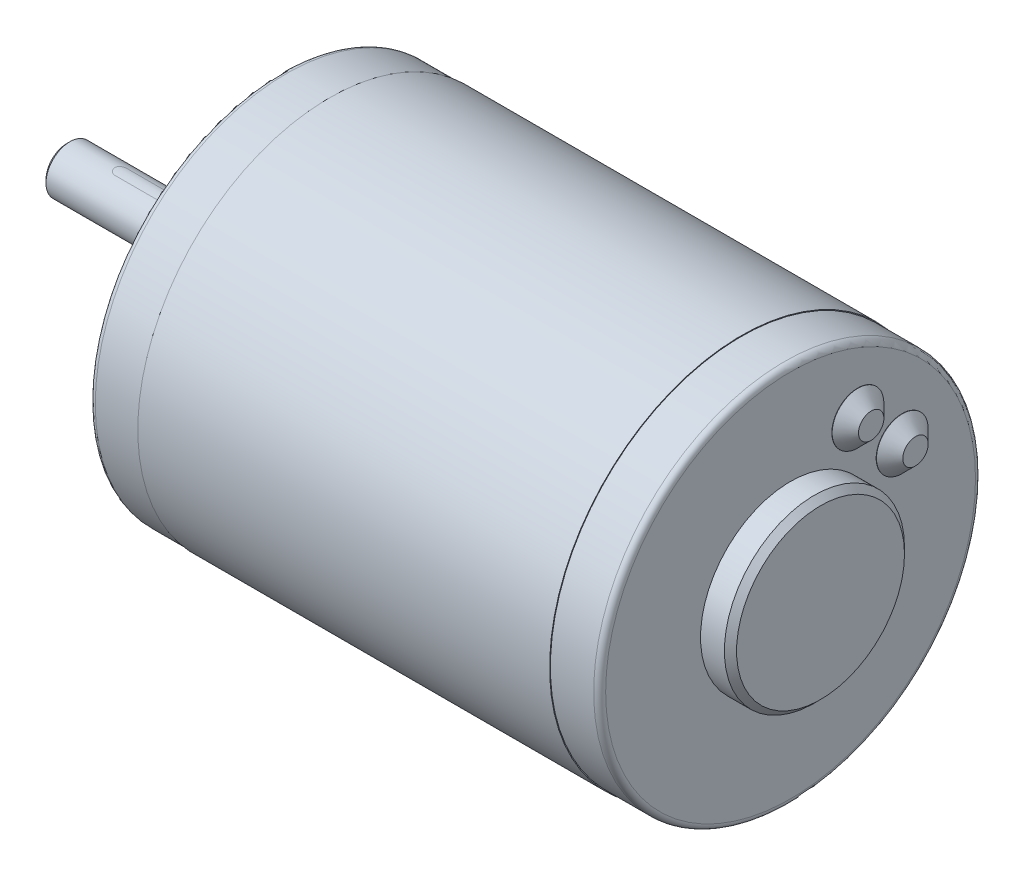
ISO-10303-21;
HEADER;
FILE_DESCRIPTION(('STEP AP214'),'2;1');
FILE_NAME('part.step','',(''),(''),'','','');
FILE_SCHEMA(('AUTOMOTIVE_DESIGN { 1 0 10303 214 1 1 1 1 }'));
ENDSEC;
DATA;
#1=APPLICATION_CONTEXT('core data for automotive mechanical design processes');
#2=APPLICATION_PROTOCOL_DEFINITION('international standard','automotive_design',2000,#1);
#3=PRODUCT_CONTEXT('',#1,'mechanical');
#4=PRODUCT('Part','Part','',(#3));
#5=PRODUCT_RELATED_PRODUCT_CATEGORY('part','',(#4));
#6=PRODUCT_DEFINITION_FORMATION('','',#4);
#7=PRODUCT_DEFINITION_CONTEXT('part definition',#1,'design');
#8=PRODUCT_DEFINITION('design','',#6,#7);
#9=PRODUCT_DEFINITION_SHAPE('','',#8);
#10=(LENGTH_UNIT() NAMED_UNIT(*) SI_UNIT(.MILLI.,.METRE.));
#11=(NAMED_UNIT(*) PLANE_ANGLE_UNIT() SI_UNIT($,.RADIAN.));
#12=(NAMED_UNIT(*) SI_UNIT($,.STERADIAN.) SOLID_ANGLE_UNIT());
#13=UNCERTAINTY_MEASURE_WITH_UNIT(LENGTH_MEASURE(1.E-05),#10,'distance_accuracy_value','');
#14=(GEOMETRIC_REPRESENTATION_CONTEXT(3) GLOBAL_UNCERTAINTY_ASSIGNED_CONTEXT((#13)) GLOBAL_UNIT_ASSIGNED_CONTEXT((#10,
#11,#12)) REPRESENTATION_CONTEXT('',''));
#15=CARTESIAN_POINT('',(0.,0.,0.));
#16=DIRECTION('',(0.,0.,1.));
#17=DIRECTION('',(1.,0.,0.));
#18=AXIS2_PLACEMENT_3D('',#15,#16,#17);
#19=CARTESIAN_POINT('',(-4.,0.,0.));
#20=DIRECTION('',(-1.,0.,0.));
#21=DIRECTION('',(0.,0.,1.));
#22=AXIS2_PLACEMENT_3D('',#19,#20,#21);
#23=PLANE('',#22);
#24=CARTESIAN_POINT('',(-4.,0.,0.));
#25=DIRECTION('',(-1.,0.,0.));
#26=DIRECTION('',(0.,0.,1.));
#27=AXIS2_PLACEMENT_3D('',#24,#25,#26);
#28=CIRCLE('',#27,8.50900000000003);
#29=CARTESIAN_POINT('',(-4.,0.,8.50900000000003));
#30=VERTEX_POINT('',#29);
#31=EDGE_CURVE('P0_E191',#30,#30,#28,.T.);
#32=ORIENTED_EDGE('',*,*,#31,.T.);
#33=EDGE_LOOP('',(#32));
#34=FACE_BOUND('',#33,.T.);
#35=CARTESIAN_POINT('',(-4.,0.,0.));
#36=DIRECTION('',(-1.,0.,0.));
#37=DIRECTION('',(0.,0.,1.));
#38=AXIS2_PLACEMENT_3D('',#35,#36,#37);
#39=CIRCLE('',#38,4.);
#40=CARTESIAN_POINT('',(-4.,0.,4.));
#41=VERTEX_POINT('',#40);
#42=EDGE_CURVE('P0_E123',#41,#41,#39,.T.);
#43=ORIENTED_EDGE('',*,*,#42,.F.);
#44=EDGE_LOOP('',(#43));
#45=FACE_BOUND('',#44,.T.);
#46=ADVANCED_FACE('P0_F40',(#34,#45),#23,.T.);
#47=CARTESIAN_POINT('',(0.,0.,0.));
#48=DIRECTION('',(-1.,0.,0.));
#49=DIRECTION('',(0.,0.,1.));
#50=AXIS2_PLACEMENT_3D('',#47,#48,#49);
#51=PLANE('',#50);
#52=CARTESIAN_POINT('',(0.,0.,0.));
#53=DIRECTION('',(-1.,0.,0.));
#54=DIRECTION('',(0.,0.,1.));
#55=AXIS2_PLACEMENT_3D('',#52,#53,#54);
#56=CIRCLE('',#55,30.877);
#57=CARTESIAN_POINT('',(0.,0.,30.877));
#58=VERTEX_POINT('',#57);
#59=EDGE_CURVE('P0_E209',#58,#58,#56,.T.);
#60=ORIENTED_EDGE('',*,*,#59,.T.);
#61=EDGE_LOOP('',(#60));
#62=FACE_BOUND('',#61,.T.);
#63=CARTESIAN_POINT('',(0.,25.4,0.));
#64=DIRECTION('',(-1.,0.,0.));
#65=DIRECTION('',(0.,0.,1.));
#66=AXIS2_PLACEMENT_3D('',#63,#64,#65);
#67=CIRCLE('',#66,2.01929999999999);
#68=CARTESIAN_POINT('',(0.,25.4,2.01929999999999));
#69=VERTEX_POINT('',#68);
#70=EDGE_CURVE('P0_E97',#69,#69,#67,.T.);
#71=ORIENTED_EDGE('',*,*,#70,.F.);
#72=EDGE_LOOP('',(#71));
#73=FACE_BOUND('',#72,.T.);
#74=CARTESIAN_POINT('',(0.,-25.4,0.));
#75=DIRECTION('',(-1.,0.,0.));
#76=DIRECTION('',(0.,0.,1.));
#77=AXIS2_PLACEMENT_3D('',#74,#75,#76);
#78=CIRCLE('',#77,2.01929999999999);
#79=CARTESIAN_POINT('',(0.,-25.4,2.01929999999999));
#80=VERTEX_POINT('',#79);
#81=EDGE_CURVE('P0_E96',#80,#80,#78,.T.);
#82=ORIENTED_EDGE('',*,*,#81,.F.);
#83=EDGE_LOOP('',(#82));
#84=FACE_BOUND('',#83,.T.);
#85=CARTESIAN_POINT('',(0.,0.,0.));
#86=DIRECTION('',(-1.,0.,0.));
#87=DIRECTION('',(0.,0.,1.));
#88=AXIS2_PLACEMENT_3D('',#85,#86,#87);
#89=CIRCLE('',#88,9.525);
#90=CARTESIAN_POINT('',(0.,0.,9.525));
#91=VERTEX_POINT('',#90);
#92=EDGE_CURVE('P0_E167',#91,#91,#89,.T.);
#93=ORIENTED_EDGE('',*,*,#92,.F.);
#94=EDGE_LOOP('',(#93));
#95=FACE_BOUND('',#94,.T.);
#96=ADVANCED_FACE('P0_F230',(#62,#73,#84,#95),#51,.T.);
#97=CARTESIAN_POINT('',(8.2296,32.004,0.));
#98=DIRECTION('',(-1.,0.,0.));
#99=DIRECTION('',(0.,0.,1.));
#100=AXIS2_PLACEMENT_3D('',#97,#98,#99);
#101=PLANE('',#100);
#102=CARTESIAN_POINT('',(8.2296,0.,0.));
#103=DIRECTION('',(1.,0.,0.));
#104=DIRECTION('',(0.,0.,-1.));
#105=AXIS2_PLACEMENT_3D('',#102,#103,#104);
#106=CIRCLE('',#105,32.004);
#107=CARTESIAN_POINT('',(8.2296,0.,-32.004));
#108=VERTEX_POINT('',#107);
#109=EDGE_CURVE('P0_E182',#108,#108,#106,.T.);
#110=ORIENTED_EDGE('',*,*,#109,.F.);
#111=EDGE_LOOP('',(#110));
#112=FACE_BOUND('',#111,.T.);
#113=CARTESIAN_POINT('',(8.2296,0.,0.));
#114=DIRECTION('',(-1.,0.,0.));
#115=DIRECTION('',(0.,0.,1.));
#116=AXIS2_PLACEMENT_3D('',#113,#114,#115);
#117=CIRCLE('',#116,31.877);
#118=CARTESIAN_POINT('',(8.2296,0.,31.877));
#119=VERTEX_POINT('',#118);
#120=EDGE_CURVE('P0_E170',#119,#119,#117,.T.);
#121=ORIENTED_EDGE('',*,*,#120,.F.);
#122=EDGE_LOOP('',(#121));
#123=FACE_BOUND('',#122,.T.);
#124=ADVANCED_FACE('P0_F236',(#112,#123),#101,.T.);
#125=CARTESIAN_POINT('',(85.216,0.,0.));
#126=DIRECTION('',(1.,0.,0.));
#127=DIRECTION('',(0.,0.,-1.));
#128=AXIS2_PLACEMENT_3D('',#125,#126,#127);
#129=PLANE('',#128);
#130=CARTESIAN_POINT('',(85.216,0.,0.));
#131=DIRECTION('',(1.,0.,0.));
#132=DIRECTION('',(0.,0.,-1.));
#133=AXIS2_PLACEMENT_3D('',#130,#131,#132);
#134=CIRCLE('',#133,30.877);
#135=CARTESIAN_POINT('',(85.216,0.,-30.877));
#136=VERTEX_POINT('',#135);
#137=EDGE_CURVE('P0_E48',#136,#136,#134,.T.);
#138=ORIENTED_EDGE('',*,*,#137,.T.);
#139=EDGE_LOOP('',(#138));
#140=FACE_BOUND('',#139,.T.);
#141=CARTESIAN_POINT('',(85.216,18.6070906828553,-11.2073596390943));
#142=DIRECTION('',(1.,0.,0.));
#143=DIRECTION('',(0.,0.,-1.));
#144=AXIS2_PLACEMENT_3D('',#141,#142,#143);
#145=CIRCLE('',#144,4.318);
#146=CARTESIAN_POINT('',(85.216,18.6070906828553,-15.5253596390943));
#147=VERTEX_POINT('',#146);
#148=EDGE_CURVE('P0_E188',#147,#147,#145,.T.);
#149=ORIENTED_EDGE('',*,*,#148,.F.);
#150=EDGE_LOOP('',(#149));
#151=FACE_BOUND('',#150,.T.);
#152=CARTESIAN_POINT('',(85.216,11.2073596390943,-18.6070906828553));
#153=DIRECTION('',(1.,0.,0.));
#154=DIRECTION('',(0.,0.,-1.));
#155=AXIS2_PLACEMENT_3D('',#152,#153,#154);
#156=CIRCLE('',#155,4.318);
#157=CARTESIAN_POINT('',(85.216,11.2073596390943,-22.9250906828553));
#158=VERTEX_POINT('',#157);
#159=EDGE_CURVE('P0_E185',#158,#158,#156,.T.);
#160=ORIENTED_EDGE('',*,*,#159,.F.);
#161=EDGE_LOOP('',(#160));
#162=FACE_BOUND('',#161,.T.);
#163=CARTESIAN_POINT('',(85.216,0.,0.));
#164=DIRECTION('',(1.,0.,0.));
#165=DIRECTION('',(0.,0.,-1.));
#166=AXIS2_PLACEMENT_3D('',#163,#164,#165);
#167=CIRCLE('',#166,15.0368);
#168=CARTESIAN_POINT('',(85.216,0.,-15.0368));
#169=VERTEX_POINT('',#168);
#170=EDGE_CURVE('P0_E173',#169,#169,#167,.T.);
#171=ORIENTED_EDGE('',*,*,#170,.F.);
#172=EDGE_LOOP('',(#171));
#173=FACE_BOUND('',#172,.T.);
#174=ADVANCED_FACE('P0_F217',(#140,#151,#162,#173),#129,.T.);
#175=CARTESIAN_POINT('',(76.9864,0.,0.));
#176=DIRECTION('',(1.,0.,0.));
#177=DIRECTION('',(0.,0.,-1.));
#178=AXIS2_PLACEMENT_3D('',#175,#176,#177);
#179=PLANE('',#178);
#180=CARTESIAN_POINT('',(76.9864,0.,0.));
#181=DIRECTION('',(1.,0.,0.));
#182=DIRECTION('',(0.,0.,-1.));
#183=AXIS2_PLACEMENT_3D('',#180,#181,#182);
#184=CIRCLE('',#183,32.004);
#185=CARTESIAN_POINT('',(76.9864,0.,-32.004));
#186=VERTEX_POINT('',#185);
#187=EDGE_CURVE('P0_E179',#186,#186,#184,.T.);
#188=ORIENTED_EDGE('',*,*,#187,.T.);
#189=EDGE_LOOP('',(#188));
#190=FACE_BOUND('',#189,.T.);
#191=CARTESIAN_POINT('',(76.9864,0.,0.));
#192=DIRECTION('',(1.,0.,0.));
#193=DIRECTION('',(0.,0.,-1.));
#194=AXIS2_PLACEMENT_3D('',#191,#192,#193);
#195=CIRCLE('',#194,31.877);
#196=CARTESIAN_POINT('',(76.9864,0.,-31.877));
#197=VERTEX_POINT('',#196);
#198=EDGE_CURVE('P0_E176',#197,#197,#195,.T.);
#199=ORIENTED_EDGE('',*,*,#198,.F.);
#200=EDGE_LOOP('',(#199));
#201=FACE_BOUND('',#200,.T.);
#202=ADVANCED_FACE('P0_F263',(#190,#201),#179,.T.);
#203=CARTESIAN_POINT('',(8.2296,0.,0.));
#204=DIRECTION('',(1.,0.,0.));
#205=DIRECTION('',(0.,0.,-1.));
#206=AXIS2_PLACEMENT_3D('',#203,#204,#205);
#207=CYLINDRICAL_SURFACE('',#206,32.004);
#208=ORIENTED_EDGE('',*,*,#109,.T.);
#209=EDGE_LOOP('',(#208));
#210=FACE_BOUND('',#209,.T.);
#211=ORIENTED_EDGE('',*,*,#187,.F.);
#212=EDGE_LOOP('',(#211));
#213=FACE_BOUND('',#212,.T.);
#214=ADVANCED_FACE('P0_F266',(#210,#213),#207,.T.);
#215=CARTESIAN_POINT('',(85.216,0.,0.));
#216=DIRECTION('',(-1.,0.,0.));
#217=DIRECTION('',(0.,0.,1.));
#218=AXIS2_PLACEMENT_3D('',#215,#216,#217);
#219=CYLINDRICAL_SURFACE('',#218,31.877);
#220=CARTESIAN_POINT('',(84.216,0.,0.));
#221=DIRECTION('',(1.,0.,0.));
#222=DIRECTION('',(0.,0.,-1.));
#223=AXIS2_PLACEMENT_3D('',#220,#221,#222);
#224=CIRCLE('',#223,31.877);
#225=CARTESIAN_POINT('',(84.216,0.,-31.877));
#226=VERTEX_POINT('',#225);
#227=EDGE_CURVE('P0_E11',#226,#226,#224,.F.);
#228=ORIENTED_EDGE('',*,*,#227,.T.);
#229=EDGE_LOOP('',(#228));
#230=FACE_BOUND('',#229,.T.);
#231=ORIENTED_EDGE('',*,*,#198,.T.);
#232=EDGE_LOOP('',(#231));
#233=FACE_BOUND('',#232,.T.);
#234=ADVANCED_FACE('P0_F259',(#230,#233),#219,.T.);
#235=CARTESIAN_POINT('',(90.216,0.,0.));
#236=DIRECTION('',(-1.,0.,0.));
#237=DIRECTION('',(0.,0.,1.));
#238=AXIS2_PLACEMENT_3D('',#235,#236,#237);
#239=CYLINDRICAL_SURFACE('',#238,15.0368);
#240=CARTESIAN_POINT('',(89.2,0.,0.));
#241=DIRECTION('',(1.,0.,0.));
#242=DIRECTION('',(0.,0.,-1.));
#243=AXIS2_PLACEMENT_3D('',#240,#241,#242);
#244=CIRCLE('',#243,15.0368);
#245=CARTESIAN_POINT('',(89.2,0.,-15.0368));
#246=VERTEX_POINT('',#245);
#247=EDGE_CURVE('P0_E200',#246,#246,#244,.F.);
#248=ORIENTED_EDGE('',*,*,#247,.T.);
#249=EDGE_LOOP('',(#248));
#250=FACE_BOUND('',#249,.T.);
#251=ORIENTED_EDGE('',*,*,#170,.T.);
#252=EDGE_LOOP('',(#251));
#253=FACE_BOUND('',#252,.T.);
#254=ADVANCED_FACE('P0_F255',(#250,#253),#239,.T.);
#255=CARTESIAN_POINT('',(90.216,0.,0.));
#256=DIRECTION('',(1.,0.,0.));
#257=DIRECTION('',(0.,0.,-1.));
#258=AXIS2_PLACEMENT_3D('',#255,#256,#257);
#259=PLANE('',#258);
#260=CARTESIAN_POINT('',(90.216,0.,0.));
#261=DIRECTION('',(1.,0.,0.));
#262=DIRECTION('',(0.,0.,-1.));
#263=AXIS2_PLACEMENT_3D('',#260,#261,#262);
#264=CIRCLE('',#263,14.0208);
#265=CARTESIAN_POINT('',(90.216,0.,-14.0208));
#266=VERTEX_POINT('',#265);
#267=EDGE_CURVE('P0_E197',#266,#266,#264,.T.);
#268=ORIENTED_EDGE('',*,*,#267,.T.);
#269=EDGE_LOOP('',(#268));
#270=FACE_BOUND('',#269,.T.);
#271=ADVANCED_FACE('P0_F251',(#270),#259,.T.);
#272=CARTESIAN_POINT('',(0.,0.,0.));
#273=DIRECTION('',(1.,0.,0.));
#274=DIRECTION('',(0.,0.,-1.));
#275=AXIS2_PLACEMENT_3D('',#272,#273,#274);
#276=CYLINDRICAL_SURFACE('',#275,31.877);
#277=CARTESIAN_POINT('',(0.999999999999997,0.,0.));
#278=DIRECTION('',(-1.,0.,0.));
#279=DIRECTION('',(0.,0.,1.));
#280=AXIS2_PLACEMENT_3D('',#277,#278,#279);
#281=CIRCLE('',#280,31.877);
#282=CARTESIAN_POINT('',(0.999999999999997,0.,31.877));
#283=VERTEX_POINT('',#282);
#284=EDGE_CURVE('P0_E212',#283,#283,#281,.F.);
#285=ORIENTED_EDGE('',*,*,#284,.T.);
#286=EDGE_LOOP('',(#285));
#287=FACE_BOUND('',#286,.T.);
#288=ORIENTED_EDGE('',*,*,#120,.T.);
#289=EDGE_LOOP('',(#288));
#290=FACE_BOUND('',#289,.T.);
#291=ADVANCED_FACE('P0_F246',(#287,#290),#276,.T.);
#292=CARTESIAN_POINT('',(-4.,0.,0.));
#293=DIRECTION('',(1.,0.,0.));
#294=DIRECTION('',(0.,0.,-1.));
#295=AXIS2_PLACEMENT_3D('',#292,#293,#294);
#296=CYLINDRICAL_SURFACE('',#295,9.525);
#297=CARTESIAN_POINT('',(-2.98400000000003,0.,0.));
#298=DIRECTION('',(-1.,0.,0.));
#299=DIRECTION('',(0.,0.,1.));
#300=AXIS2_PLACEMENT_3D('',#297,#298,#299);
#301=CIRCLE('',#300,9.525);
#302=CARTESIAN_POINT('',(-2.98400000000003,0.,9.525));
#303=VERTEX_POINT('',#302);
#304=EDGE_CURVE('P0_E194',#303,#303,#301,.F.);
#305=ORIENTED_EDGE('',*,*,#304,.T.);
#306=EDGE_LOOP('',(#305));
#307=FACE_BOUND('',#306,.T.);
#308=ORIENTED_EDGE('',*,*,#92,.T.);
#309=EDGE_LOOP('',(#308));
#310=FACE_BOUND('',#309,.T.);
#311=ADVANCED_FACE('P0_F244',(#307,#310),#296,.T.);
#312=CARTESIAN_POINT('',(-35.6,0.,0.));
#313=DIRECTION('',(1.,0.,0.));
#314=DIRECTION('',(0.,0.,-1.));
#315=AXIS2_PLACEMENT_3D('',#312,#313,#314);
#316=CYLINDRICAL_SURFACE('',#315,4.);
#317=CARTESIAN_POINT('',(-35.0999999999929,0.,0.));
#318=DIRECTION('',(-1.,0.,0.));
#319=DIRECTION('',(0.,0.,1.));
#320=AXIS2_PLACEMENT_3D('',#317,#318,#319);
#321=CIRCLE('',#320,4.);
#322=CARTESIAN_POINT('',(-35.0999999999929,0.,4.));
#323=VERTEX_POINT('',#322);
#324=EDGE_CURVE('P0_E206',#323,#323,#321,.F.);
#325=ORIENTED_EDGE('',*,*,#324,.T.);
#326=EDGE_LOOP('',(#325));
#327=FACE_BOUND('',#326,.T.);
#328=DIRECTION('',(1.,0.,0.));
#329=VECTOR('',#328,1.);
#330=CARTESIAN_POINT('',(0.,3.87298334620741,-1.));
#331=LINE('',#330,#329);
#332=CARTESIAN_POINT('',(-26.6,3.87298334620741,-1.));
#333=VERTEX_POINT('',#332);
#334=CARTESIAN_POINT('',(-7.1,3.87298334620741,-1.));
#335=VERTEX_POINT('',#334);
#336=EDGE_CURVE('P0_E142',#333,#335,#331,.T.);
#337=ORIENTED_EDGE('',*,*,#336,.T.);
#338=CARTESIAN_POINT('',(-7.1,3.87298334620741,-1.));
#339=CARTESIAN_POINT('',(-7.07233701489346,3.87298148580177,-1.00000033749611));
#340=CARTESIAN_POINT('',(-7.04468773698177,3.8732800994947,-0.998851407375366));
#341=CARTESIAN_POINT('',(-6.98959596469644,3.87445904774558,-0.994271295395754));
#342=CARTESIAN_POINT('',(-6.96215343631291,3.87533928441687,-0.990840497572679));
#343=CARTESIAN_POINT('',(-6.88054682679116,3.87881710972053,-0.977175239382526));
#344=CARTESIAN_POINT('',(-6.82694353151779,3.88225203148808,-0.963567695172493));
#345=CARTESIAN_POINT('',(-6.72287532621804,3.89095422588002,-0.927798076247997));
#346=CARTESIAN_POINT('',(-6.67241012178714,3.89622132630929,-0.905636805423836));
#347=CARTESIAN_POINT('',(-6.57588855135267,3.90799134471939,-0.853415378025865));
#348=CARTESIAN_POINT('',(-6.52983337210904,3.91449459395647,-0.823353103356933));
#349=CARTESIAN_POINT('',(-6.4424561180939,3.92816262398025,-0.755484471828069));
#350=CARTESIAN_POINT('',(-6.40124511375448,3.93533791028915,-0.717537268783976));
#351=CARTESIAN_POINT('',(-6.32569791051729,3.94945104396193,-0.63527578051623));
#352=CARTESIAN_POINT('',(-6.29136281053206,3.95638885322537,-0.590960479478831));
#353=CARTESIAN_POINT('',(-6.23008899838136,3.96936182283248,-0.496456899401691));
#354=CARTESIAN_POINT('',(-6.20326010401603,3.9753830468173,-0.446195340334474));
#355=CARTESIAN_POINT('',(-6.1584752658033,3.98572346250588,-0.341702590842919));
#356=CARTESIAN_POINT('',(-6.14051757570017,3.990042989147,-0.28747218408301));
#357=CARTESIAN_POINT('',(-6.11434100722257,3.99641900005128,-0.17774410852516));
#358=CARTESIAN_POINT('',(-6.10593232757718,3.998519529013,-0.122294322002858));
#359=CARTESIAN_POINT('',(-6.09849662845671,4.00037438150815,-0.0107327756816796));
#360=CARTESIAN_POINT('',(-6.09946842980766,4.00012899993444,0.0453789000287057));
#361=CARTESIAN_POINT('',(-6.11062996368545,3.99735237365735,0.155352492972096));
#362=CARTESIAN_POINT('',(-6.12061461659948,3.9948719867736,0.209236701739855));
#363=CARTESIAN_POINT('',(-6.14918867918275,3.98796330636495,0.31453871108434));
#364=CARTESIAN_POINT('',(-6.16777846956858,3.98353492665556,0.365956402423988));
#365=CARTESIAN_POINT('',(-6.21320128067065,3.97314997761798,0.465407286024539));
#366=CARTESIAN_POINT('',(-6.24010739423284,3.96717993827555,0.513405629602248));
#367=CARTESIAN_POINT('',(-6.30134312983347,3.95435945541919,0.604276631230014));
#368=CARTESIAN_POINT('',(-6.33567387025322,3.94750887933198,0.647148515562289));
#369=CARTESIAN_POINT('',(-6.41187891208131,3.93345566022865,0.72776938970849));
#370=CARTESIAN_POINT('',(-6.45393163653981,3.92624850477685,0.765349103054127));
#371=CARTESIAN_POINT('',(-6.54382986692773,3.91246168284006,0.832969575186237));
#372=CARTESIAN_POINT('',(-6.59167695328356,3.90588218842993,0.863008270245062));
#373=CARTESIAN_POINT('',(-6.69214559782377,3.89407813586325,0.914804709285962));
#374=CARTESIAN_POINT('',(-6.74479146489609,3.88886106009136,0.936517017887269));
#375=CARTESIAN_POINT('',(-6.85311692841829,3.88047058807055,0.970702351849829));
#376=CARTESIAN_POINT('',(-6.90879185514984,3.87729413761435,0.983189189212132));
#377=CARTESIAN_POINT('',(-6.9874573807589,3.87455290681524,0.993904635150938));
#378=CARTESIAN_POINT('',(-7.00991970321318,3.87396523110859,0.996190790966708));
#379=CARTESIAN_POINT('',(-7.05491778990932,3.87318062488974,0.999236757697394));
#380=CARTESIAN_POINT('',(-7.07745337595529,3.87298306219461,0.999999038096045));
#381=CARTESIAN_POINT('',(-7.1,3.87298334620741,1.));
#382=B_SPLINE_CURVE_WITH_KNOTS('',3,(#338,#339,#340,#341,#342,#343,#344,#345,#346,#347,#348,
#349,#350,#351,#352,#353,#354,#355,#356,#357,#358,#359,#360,#361,#362,#363,#364,#365,#366,#367,
#368,#369,#370,#371,#372,#373,#374,#375,#376,#377,#378,#379,#380,#381),.UNSPECIFIED.,.F.,.F.,(4,
2,2,2,2,2,2,2,2,2,2,2,2,2,2,2,2,2,2,2,2,4),(0.,0.0829365303397693,0.165859106084651,
0.331229963080317,0.496585282091498,0.661984974726749,0.830641897427974,0.999325753539193,
1.17036187098235,1.34136430732424,1.50890481515325,1.67642426256639,1.84022545479276,
2.00403389475838,2.16932509450376,2.33464120964329,2.50441429534542,2.67423379180967,
2.84496720161068,3.01544447539986,3.08315848722648,3.15076267731671),.UNSPECIFIED.);
#383=CARTESIAN_POINT('',(-7.1,3.87298334620741,1.));
#384=VERTEX_POINT('',#383);
#385=EDGE_CURVE('P0_E119',#335,#384,#382,.T.);
#386=ORIENTED_EDGE('',*,*,#385,.T.);
#387=DIRECTION('',(1.,0.,0.));
#388=VECTOR('',#387,1.);
#389=CARTESIAN_POINT('',(0.,3.87298334620741,1.));
#390=LINE('',#389,#388);
#391=CARTESIAN_POINT('',(-26.6,3.87298334620741,1.));
#392=VERTEX_POINT('',#391);
#393=EDGE_CURVE('P0_E157',#384,#392,#390,.F.);
#394=ORIENTED_EDGE('',*,*,#393,.T.);
#395=CARTESIAN_POINT('',(-26.6,3.87298334620741,1.));
#396=CARTESIAN_POINT('',(-26.6276629851065,3.87298148580177,1.00000033749611));
#397=CARTESIAN_POINT('',(-26.6553122630182,3.8732800994947,0.998851407375366));
#398=CARTESIAN_POINT('',(-26.7104040353036,3.87445904774558,0.994271295395754));
#399=CARTESIAN_POINT('',(-26.7378465636871,3.87533928441687,0.990840497572679));
#400=CARTESIAN_POINT('',(-26.8194531732088,3.87881710972053,0.977175239382526));
#401=CARTESIAN_POINT('',(-26.8730564684822,3.88225203148808,0.963567695172493));
#402=CARTESIAN_POINT('',(-26.977124673782,3.89095422588002,0.927798076247996));
#403=CARTESIAN_POINT('',(-27.0275898782129,3.89622132630929,0.905636805423835));
#404=CARTESIAN_POINT('',(-27.1241114486473,3.90799134471939,0.853415378025864));
#405=CARTESIAN_POINT('',(-27.170166627891,3.91449459395647,0.823353103356932));
#406=CARTESIAN_POINT('',(-27.2575438819061,3.92816262398025,0.755484471828069));
#407=CARTESIAN_POINT('',(-27.2987548862455,3.93533791028915,0.717537268783975));
#408=CARTESIAN_POINT('',(-27.3743020894827,3.94945104396193,0.635275780516229));
#409=CARTESIAN_POINT('',(-27.4086371894679,3.95638885322537,0.59096047947883));
#410=CARTESIAN_POINT('',(-27.4699110016186,3.96936182283248,0.496456899401689));
#411=CARTESIAN_POINT('',(-27.496739895984,3.9753830468173,0.446195340334472));
#412=CARTESIAN_POINT('',(-27.5415247341967,3.98572346250588,0.341702590842916));
#413=CARTESIAN_POINT('',(-27.5594824242998,3.990042989147,0.287472184083007));
#414=CARTESIAN_POINT('',(-27.5856589927774,3.99641900005128,0.177744108525158));
#415=CARTESIAN_POINT('',(-27.5940676724228,3.998519529013,0.122294322002856));
#416=CARTESIAN_POINT('',(-27.6015033715433,4.00037438150815,0.0107327756816781));
#417=CARTESIAN_POINT('',(-27.6005315701923,4.00012899993444,-0.0453789000287067));
#418=CARTESIAN_POINT('',(-27.5893700363146,3.99735237365735,-0.155352492972096));
#419=CARTESIAN_POINT('',(-27.5793853834005,3.9948719867736,-0.209236701739855));
#420=CARTESIAN_POINT('',(-27.5508113208173,3.98796330636495,-0.31453871108434));
#421=CARTESIAN_POINT('',(-27.5322215304314,3.98353492665556,-0.365956402423988));
#422=CARTESIAN_POINT('',(-27.4867987193294,3.97314997761798,-0.46540728602454));
#423=CARTESIAN_POINT('',(-27.4598926057672,3.96717993827555,-0.513405629602248));
#424=CARTESIAN_POINT('',(-27.3986568701665,3.95435945541919,-0.604276631230015));
#425=CARTESIAN_POINT('',(-27.3643261297468,3.94750887933198,-0.64714851556229));
#426=CARTESIAN_POINT('',(-27.2881210879187,3.93345566022865,-0.727769389708492));
#427=CARTESIAN_POINT('',(-27.2460683634602,3.92624850477685,-0.765349103054128));
#428=CARTESIAN_POINT('',(-27.1561701330723,3.91246168284006,-0.832969575186237));
#429=CARTESIAN_POINT('',(-27.1083230467164,3.90588218842993,-0.863008270245062));
#430=CARTESIAN_POINT('',(-27.0078544021762,3.89407813586325,-0.914804709285961));
#431=CARTESIAN_POINT('',(-26.9552085351039,3.88886106009136,-0.936517017887269));
#432=CARTESIAN_POINT('',(-26.8468830715817,3.88047058807054,-0.970702351849828));
#433=CARTESIAN_POINT('',(-26.7912081448502,3.87729413761435,-0.983189189212131));
#434=CARTESIAN_POINT('',(-26.7125426192411,3.87455290681524,-0.993904635150938));
#435=CARTESIAN_POINT('',(-26.6900802967868,3.87396523110859,-0.996190790966708));
#436=CARTESIAN_POINT('',(-26.6450822100907,3.87318062488974,-0.999236757697394));
#437=CARTESIAN_POINT('',(-26.6225466240447,3.87298306219461,-0.999999038096045));
#438=CARTESIAN_POINT('',(-26.6,3.87298334620741,-1.));
#439=B_SPLINE_CURVE_WITH_KNOTS('',3,(#395,#396,#397,#398,#399,#400,#401,#402,#403,#404,#405,
#406,#407,#408,#409,#410,#411,#412,#413,#414,#415,#416,#417,#418,#419,#420,#421,#422,#423,#424,
#425,#426,#427,#428,#429,#430,#431,#432,#433,#434,#435,#436,#437,#438),.UNSPECIFIED.,.F.,.F.,(4,
2,2,2,2,2,2,2,2,2,2,2,2,2,2,2,2,2,2,2,2,4),(0.,0.0829365303397727,0.165859106084653,
0.331229963080318,0.496585282091499,0.661984974726751,0.830641897427976,0.999325753539196,
1.17036187098235,1.34136430732425,1.50890481515325,1.67642426256639,1.84022545479276,
2.00403389475838,2.16932509450376,2.33464120964329,2.50441429534542,2.67423379180967,
2.84496720161068,3.01544447539986,3.08315848722649,3.15076267731671),.UNSPECIFIED.);
#440=EDGE_CURVE('P0_E55',#392,#333,#439,.T.);
#441=ORIENTED_EDGE('',*,*,#440,.T.);
#442=EDGE_LOOP('',(#337,#386,#394,#441));
#443=FACE_BOUND('',#442,.T.);
#444=ORIENTED_EDGE('',*,*,#42,.T.);
#445=EDGE_LOOP('',(#444));
#446=FACE_BOUND('',#445,.T.);
#447=ADVANCED_FACE('P0_F242',(#327,#443,#446),#316,.T.);
#448=CARTESIAN_POINT('',(-35.6,0.,0.));
#449=DIRECTION('',(-1.,0.,0.));
#450=DIRECTION('',(0.,0.,1.));
#451=AXIS2_PLACEMENT_3D('',#448,#449,#450);
#452=PLANE('',#451);
#453=CARTESIAN_POINT('',(-35.6,0.,0.));
#454=DIRECTION('',(-1.,0.,0.));
#455=DIRECTION('',(0.,0.,1.));
#456=AXIS2_PLACEMENT_3D('',#453,#454,#455);
#457=CIRCLE('',#456,3.4999999999361);
#458=CARTESIAN_POINT('',(-35.6,0.,3.4999999999361));
#459=VERTEX_POINT('',#458);
#460=EDGE_CURVE('P0_E203',#459,#459,#457,.T.);
#461=ORIENTED_EDGE('',*,*,#460,.T.);
#462=EDGE_LOOP('',(#461));
#463=FACE_BOUND('',#462,.T.);
#464=ADVANCED_FACE('P0_F293',(#463),#452,.T.);
#465=CARTESIAN_POINT('',(-7.1,32.005,0.));
#466=DIRECTION('',(0.,-1.,0.));
#467=DIRECTION('',(0.,0.,-1.));
#468=AXIS2_PLACEMENT_3D('',#465,#466,#467);
#469=CYLINDRICAL_SURFACE('',#468,1.);
#470=ORIENTED_EDGE('',*,*,#385,.F.);
#471=DIRECTION('',(0.,-1.,0.));
#472=VECTOR('',#471,1.);
#473=CARTESIAN_POINT('',(-7.1,32.005,-1.));
#474=LINE('',#473,#472);
#475=CARTESIAN_POINT('',(-7.1,2.79999999999999,-1.));
#476=VERTEX_POINT('',#475);
#477=EDGE_CURVE('P0_E141',#335,#476,#474,.T.);
#478=ORIENTED_EDGE('',*,*,#477,.T.);
#479=CARTESIAN_POINT('',(-7.1,2.79999999999999,0.));
#480=DIRECTION('',(0.,-1.,0.));
#481=DIRECTION('',(0.,0.,-1.));
#482=AXIS2_PLACEMENT_3D('',#479,#480,#481);
#483=CIRCLE('',#482,1.);
#484=CARTESIAN_POINT('',(-7.1,2.79999999999999,1.));
#485=VERTEX_POINT('',#484);
#486=EDGE_CURVE('P0_E130',#476,#485,#483,.T.);
#487=ORIENTED_EDGE('',*,*,#486,.T.);
#488=DIRECTION('',(0.,-1.,0.));
#489=VECTOR('',#488,1.);
#490=CARTESIAN_POINT('',(-7.1,32.005,1.));
#491=LINE('',#490,#489);
#492=EDGE_CURVE('P0_E63',#384,#485,#491,.T.);
#493=ORIENTED_EDGE('',*,*,#492,.F.);
#494=EDGE_LOOP('',(#470,#478,#487,#493));
#495=FACE_BOUND('',#494,.T.);
#496=ADVANCED_FACE('P0_F295',(#495),#469,.F.);
#497=CARTESIAN_POINT('',(-26.6,32.005,-1.));
#498=DIRECTION('',(0.,0.,-1.));
#499=DIRECTION('',(-1.,0.,0.));
#500=AXIS2_PLACEMENT_3D('',#497,#498,#499);
#501=PLANE('',#500);
#502=ORIENTED_EDGE('',*,*,#336,.F.);
#503=DIRECTION('',(0.,-1.,0.));
#504=VECTOR('',#503,1.);
#505=CARTESIAN_POINT('',(-26.6,32.005,-1.));
#506=LINE('',#505,#504);
#507=CARTESIAN_POINT('',(-26.6,2.79999999999999,-1.));
#508=VERTEX_POINT('',#507);
#509=EDGE_CURVE('P0_E140',#333,#508,#506,.T.);
#510=ORIENTED_EDGE('',*,*,#509,.T.);
#511=DIRECTION('',(1.,0.,0.));
#512=VECTOR('',#511,1.);
#513=CARTESIAN_POINT('',(-26.6,2.79999999999999,-1.));
#514=LINE('',#513,#512);
#515=EDGE_CURVE('P0_E120',#508,#476,#514,.T.);
#516=ORIENTED_EDGE('',*,*,#515,.T.);
#517=ORIENTED_EDGE('',*,*,#477,.F.);
#518=EDGE_LOOP('',(#502,#510,#516,#517));
#519=FACE_BOUND('',#518,.T.);
#520=ADVANCED_FACE('P0_F300',(#519),#501,.F.);
#521=CARTESIAN_POINT('',(-26.6,32.005,0.));
#522=DIRECTION('',(0.,-1.,0.));
#523=DIRECTION('',(0.,0.,-1.));
#524=AXIS2_PLACEMENT_3D('',#521,#522,#523);
#525=CYLINDRICAL_SURFACE('',#524,1.);
#526=ORIENTED_EDGE('',*,*,#440,.F.);
#527=DIRECTION('',(0.,-1.,0.));
#528=VECTOR('',#527,1.);
#529=CARTESIAN_POINT('',(-26.6,32.005,1.));
#530=LINE('',#529,#528);
#531=CARTESIAN_POINT('',(-26.6,2.79999999999999,1.));
#532=VERTEX_POINT('',#531);
#533=EDGE_CURVE('P0_E132',#392,#532,#530,.T.);
#534=ORIENTED_EDGE('',*,*,#533,.T.);
#535=CARTESIAN_POINT('',(-26.6,2.79999999999999,0.));
#536=DIRECTION('',(0.,-1.,0.));
#537=DIRECTION('',(0.,0.,-1.));
#538=AXIS2_PLACEMENT_3D('',#535,#536,#537);
#539=CIRCLE('',#538,1.);
#540=EDGE_CURVE('P0_E124',#532,#508,#539,.T.);
#541=ORIENTED_EDGE('',*,*,#540,.T.);
#542=ORIENTED_EDGE('',*,*,#509,.F.);
#543=EDGE_LOOP('',(#526,#534,#541,#542));
#544=FACE_BOUND('',#543,.T.);
#545=ADVANCED_FACE('P0_F306',(#544),#525,.F.);
#546=CARTESIAN_POINT('',(-7.1,32.005,1.));
#547=DIRECTION('',(0.,0.,1.));
#548=DIRECTION('',(1.,0.,0.));
#549=AXIS2_PLACEMENT_3D('',#546,#547,#548);
#550=PLANE('',#549);
#551=ORIENTED_EDGE('',*,*,#393,.F.);
#552=ORIENTED_EDGE('',*,*,#492,.T.);
#553=DIRECTION('',(-1.,0.,0.));
#554=VECTOR('',#553,1.);
#555=CARTESIAN_POINT('',(-7.1,2.79999999999999,1.));
#556=LINE('',#555,#554);
#557=EDGE_CURVE('P0_E127',#485,#532,#556,.T.);
#558=ORIENTED_EDGE('',*,*,#557,.T.);
#559=ORIENTED_EDGE('',*,*,#533,.F.);
#560=EDGE_LOOP('',(#551,#552,#558,#559));
#561=FACE_BOUND('',#560,.T.);
#562=ADVANCED_FACE('P0_F309',(#561),#550,.F.);
#563=CARTESIAN_POINT('',(-7.1,2.79999999999999,0.));
#564=DIRECTION('',(0.,-1.,0.));
#565=DIRECTION('',(0.,0.,-1.));
#566=AXIS2_PLACEMENT_3D('',#563,#564,#565);
#567=PLANE('',#566);
#568=ORIENTED_EDGE('',*,*,#486,.F.);
#569=ORIENTED_EDGE('',*,*,#515,.F.);
#570=ORIENTED_EDGE('',*,*,#540,.F.);
#571=ORIENTED_EDGE('',*,*,#557,.F.);
#572=EDGE_LOOP('',(#568,#569,#570,#571));
#573=FACE_BOUND('',#572,.T.);
#574=ADVANCED_FACE('P0_F311',(#573),#567,.F.);
#575=CARTESIAN_POINT('',(85.216,11.2073596390943,-18.6070906828553));
#576=DIRECTION('',(1.,0.,0.));
#577=DIRECTION('',(0.,0.,-1.));
#578=AXIS2_PLACEMENT_3D('',#575,#576,#577);
#579=CYLINDRICAL_SURFACE('',#578,4.318);
#580=ORIENTED_EDGE('',*,*,#159,.T.);
#581=EDGE_LOOP('',(#580));
#582=FACE_BOUND('',#581,.T.);
#583=CARTESIAN_POINT('',(85.2639,11.2073596390943,-18.6070906828553));
#584=DIRECTION('',(1.,0.,0.));
#585=DIRECTION('',(0.,0.,-1.));
#586=AXIS2_PLACEMENT_3D('',#583,#584,#585);
#587=CIRCLE('',#586,4.318);
#588=CARTESIAN_POINT('',(85.2639,11.2073596390943,-22.9250906828553));
#589=VERTEX_POINT('',#588);
#590=EDGE_CURVE('P0_E113',#589,#589,#587,.T.);
#591=ORIENTED_EDGE('',*,*,#590,.F.);
#592=EDGE_LOOP('',(#591));
#593=FACE_BOUND('',#592,.T.);
#594=ADVANCED_FACE('P0_F316',(#582,#593),#579,.T.);
#595=CARTESIAN_POINT('',(87.4638999999649,11.2073596390943,-18.6070906828553));
#596=DIRECTION('',(1.,0.,0.));
#597=DIRECTION('',(0.,0.,-1.));
#598=AXIS2_PLACEMENT_3D('',#595,#596,#597);
#599=PLANE('',#598);
#600=CARTESIAN_POINT('',(87.4638999999649,11.2073596390943,-18.6070906828553));
#601=DIRECTION('',(1.,0.,0.));
#602=DIRECTION('',(0.,0.,-1.));
#603=AXIS2_PLACEMENT_3D('',#600,#601,#602);
#604=CIRCLE('',#603,2.11800000003506);
#605=CARTESIAN_POINT('',(87.4638999999649,11.2073596390943,-20.7250906828904));
#606=VERTEX_POINT('',#605);
#607=EDGE_CURVE('P0_E116',#606,#606,#604,.T.);
#608=ORIENTED_EDGE('',*,*,#607,.T.);
#609=EDGE_LOOP('',(#608));
#610=FACE_BOUND('',#609,.T.);
#611=ADVANCED_FACE('P0_F339',(#610),#599,.T.);
#612=CARTESIAN_POINT('',(87.4638999999649,11.2073596390943,-18.6070906828553));
#613=DIRECTION('',(-1.,0.,0.));
#614=DIRECTION('',(0.,0.,1.));
#615=AXIS2_PLACEMENT_3D('',#612,#613,#614);
#616=CONICAL_SURFACE('',#615,2.11800000003506,0.78539816339745);
#617=ORIENTED_EDGE('',*,*,#590,.T.);
#618=EDGE_LOOP('',(#617));
#619=FACE_BOUND('',#618,.T.);
#620=ORIENTED_EDGE('',*,*,#607,.F.);
#621=EDGE_LOOP('',(#620));
#622=FACE_BOUND('',#621,.T.);
#623=ADVANCED_FACE('P0_F345',(#619,#622),#616,.T.);
#624=CARTESIAN_POINT('',(85.216,18.6070906828553,-11.2073596390943));
#625=DIRECTION('',(1.,0.,0.));
#626=DIRECTION('',(0.,0.,-1.));
#627=AXIS2_PLACEMENT_3D('',#624,#625,#626);
#628=CYLINDRICAL_SURFACE('',#627,4.318);
#629=ORIENTED_EDGE('',*,*,#148,.T.);
#630=EDGE_LOOP('',(#629));
#631=FACE_BOUND('',#630,.T.);
#632=CARTESIAN_POINT('',(85.2639,18.6070906828553,-11.2073596390943));
#633=DIRECTION('',(1.,0.,0.));
#634=DIRECTION('',(0.,0.,-1.));
#635=AXIS2_PLACEMENT_3D('',#632,#633,#634);
#636=CIRCLE('',#635,4.318);
#637=CARTESIAN_POINT('',(85.2639,18.6070906828553,-15.5253596390943));
#638=VERTEX_POINT('',#637);
#639=EDGE_CURVE('P0_E107',#638,#638,#636,.T.);
#640=ORIENTED_EDGE('',*,*,#639,.F.);
#641=EDGE_LOOP('',(#640));
#642=FACE_BOUND('',#641,.T.);
#643=ADVANCED_FACE('P0_F349',(#631,#642),#628,.T.);
#644=CARTESIAN_POINT('',(87.4638999999503,18.6070906828553,-11.2073596390943));
#645=DIRECTION('',(1.,0.,0.));
#646=DIRECTION('',(0.,0.,-1.));
#647=AXIS2_PLACEMENT_3D('',#644,#645,#646);
#648=PLANE('',#647);
#649=CARTESIAN_POINT('',(87.4638999999503,18.6070906828553,-11.2073596390943));
#650=DIRECTION('',(1.,0.,0.));
#651=DIRECTION('',(0.,0.,-1.));
#652=AXIS2_PLACEMENT_3D('',#649,#650,#651);
#653=CIRCLE('',#652,2.11800000004973);
#654=CARTESIAN_POINT('',(87.4638999999503,18.6070906828553,-13.3253596391441));
#655=VERTEX_POINT('',#654);
#656=EDGE_CURVE('P0_E110',#655,#655,#653,.T.);
#657=ORIENTED_EDGE('',*,*,#656,.T.);
#658=EDGE_LOOP('',(#657));
#659=FACE_BOUND('',#658,.T.);
#660=ADVANCED_FACE('P0_F353',(#659),#648,.T.);
#661=CARTESIAN_POINT('',(87.4638999999503,18.6070906828553,-11.2073596390943));
#662=DIRECTION('',(-1.,0.,0.));
#663=DIRECTION('',(0.,0.,1.));
#664=AXIS2_PLACEMENT_3D('',#661,#662,#663);
#665=CONICAL_SURFACE('',#664,2.11800000004973,0.785398163397448);
#666=ORIENTED_EDGE('',*,*,#639,.T.);
#667=EDGE_LOOP('',(#666));
#668=FACE_BOUND('',#667,.T.);
#669=ORIENTED_EDGE('',*,*,#656,.F.);
#670=EDGE_LOOP('',(#669));
#671=FACE_BOUND('',#670,.T.);
#672=ADVANCED_FACE('P0_F357',(#668,#671),#665,.T.);
#673=CARTESIAN_POINT('',(13.6144,-25.4,0.));
#674=DIRECTION('',(-1.,0.,0.));
#675=DIRECTION('',(0.,0.,1.));
#676=AXIS2_PLACEMENT_3D('',#673,#674,#675);
#677=CONICAL_SURFACE('',#676,2.01929999999999,1.02974425867198);
#678=CARTESIAN_POINT('',(14.8277178480152,-25.4,0.));
#679=VERTEX_POINT('',#678);
#680=VERTEX_LOOP('',#679);
#681=FACE_BOUND('',#680,.T.);
#682=CARTESIAN_POINT('',(13.6144,-25.4,0.));
#683=DIRECTION('',(-1.,0.,0.));
#684=DIRECTION('',(0.,0.,1.));
#685=AXIS2_PLACEMENT_3D('',#682,#683,#684);
#686=CIRCLE('',#685,2.01929999999999);
#687=CARTESIAN_POINT('',(13.6144,-25.4,2.01929999999999));
#688=VERTEX_POINT('',#687);
#689=EDGE_CURVE('P0_E100',#688,#688,#686,.T.);
#690=ORIENTED_EDGE('',*,*,#689,.T.);
#691=EDGE_LOOP('',(#690));
#692=FACE_BOUND('',#691,.T.);
#693=ADVANCED_FACE('P0_F361',(#681,#692),#677,.F.);
#694=CARTESIAN_POINT('',(0.,-25.4,0.));
#695=DIRECTION('',(-1.,0.,0.));
#696=DIRECTION('',(0.,0.,1.));
#697=AXIS2_PLACEMENT_3D('',#694,#695,#696);
#698=CYLINDRICAL_SURFACE('',#697,2.01929999999999);
#699=ORIENTED_EDGE('',*,*,#689,.F.);
#700=EDGE_LOOP('',(#699));
#701=FACE_BOUND('',#700,.T.);
#702=ORIENTED_EDGE('',*,*,#81,.T.);
#703=EDGE_LOOP('',(#702));
#704=FACE_BOUND('',#703,.T.);
#705=ADVANCED_FACE('P0_F90',(#701,#704),#698,.F.);
#706=CARTESIAN_POINT('',(13.6144,25.4,0.));
#707=DIRECTION('',(-1.,0.,0.));
#708=DIRECTION('',(0.,0.,1.));
#709=AXIS2_PLACEMENT_3D('',#706,#707,#708);
#710=CONICAL_SURFACE('',#709,2.01929999999999,1.02974425867198);
#711=CARTESIAN_POINT('',(14.8277178480152,25.4,0.));
#712=VERTEX_POINT('',#711);
#713=VERTEX_LOOP('',#712);
#714=FACE_BOUND('',#713,.T.);
#715=CARTESIAN_POINT('',(13.6144,25.4,0.));
#716=DIRECTION('',(-1.,0.,0.));
#717=DIRECTION('',(0.,0.,1.));
#718=AXIS2_PLACEMENT_3D('',#715,#716,#717);
#719=CIRCLE('',#718,2.01929999999999);
#720=CARTESIAN_POINT('',(13.6144,25.4,2.01929999999999));
#721=VERTEX_POINT('',#720);
#722=EDGE_CURVE('P0_E94',#721,#721,#719,.T.);
#723=ORIENTED_EDGE('',*,*,#722,.T.);
#724=EDGE_LOOP('',(#723));
#725=FACE_BOUND('',#724,.T.);
#726=ADVANCED_FACE('P0_F86',(#714,#725),#710,.F.);
#727=CARTESIAN_POINT('',(0.,25.4,0.));
#728=DIRECTION('',(-1.,0.,0.));
#729=DIRECTION('',(0.,0.,1.));
#730=AXIS2_PLACEMENT_3D('',#727,#728,#729);
#731=CYLINDRICAL_SURFACE('',#730,2.01929999999999);
#732=ORIENTED_EDGE('',*,*,#722,.F.);
#733=EDGE_LOOP('',(#732));
#734=FACE_BOUND('',#733,.T.);
#735=ORIENTED_EDGE('',*,*,#70,.T.);
#736=EDGE_LOOP('',(#735));
#737=FACE_BOUND('',#736,.T.);
#738=ADVANCED_FACE('P0_F89',(#734,#737),#731,.F.);
#739=CARTESIAN_POINT('',(-4.,0.,0.));
#740=DIRECTION('',(1.,0.,0.));
#741=DIRECTION('',(0.,0.,-1.));
#742=AXIS2_PLACEMENT_3D('',#739,#740,#741);
#743=CONICAL_SURFACE('',#742,8.50900000000003,0.785398163397447);
#744=ORIENTED_EDGE('',*,*,#304,.F.);
#745=EDGE_LOOP('',(#744));
#746=FACE_BOUND('',#745,.T.);
#747=ORIENTED_EDGE('',*,*,#31,.F.);
#748=EDGE_LOOP('',(#747));
#749=FACE_BOUND('',#748,.T.);
#750=ADVANCED_FACE('P0_F277',(#746,#749),#743,.T.);
#751=CARTESIAN_POINT('',(90.216,0.,0.));
#752=DIRECTION('',(-1.,0.,0.));
#753=DIRECTION('',(0.,0.,1.));
#754=AXIS2_PLACEMENT_3D('',#751,#752,#753);
#755=CONICAL_SURFACE('',#754,14.0208,0.785398163397447);
#756=ORIENTED_EDGE('',*,*,#247,.F.);
#757=EDGE_LOOP('',(#756));
#758=FACE_BOUND('',#757,.T.);
#759=ORIENTED_EDGE('',*,*,#267,.F.);
#760=EDGE_LOOP('',(#759));
#761=FACE_BOUND('',#760,.T.);
#762=ADVANCED_FACE('P0_F280',(#758,#761),#755,.T.);
#763=CARTESIAN_POINT('',(-35.6,0.,0.));
#764=DIRECTION('',(1.,0.,0.));
#765=DIRECTION('',(0.,0.,-1.));
#766=AXIS2_PLACEMENT_3D('',#763,#764,#765);
#767=CONICAL_SURFACE('',#766,3.4999999999361,0.785398163454291);
#768=ORIENTED_EDGE('',*,*,#324,.F.);
#769=EDGE_LOOP('',(#768));
#770=FACE_BOUND('',#769,.T.);
#771=ORIENTED_EDGE('',*,*,#460,.F.);
#772=EDGE_LOOP('',(#771));
#773=FACE_BOUND('',#772,.T.);
#774=ADVANCED_FACE('P0_F226',(#770,#773),#767,.T.);
#775=CARTESIAN_POINT('',(0.999999999999997,0.,0.));
#776=DIRECTION('',(-1.,0.,0.));
#777=DIRECTION('',(0.,0.,1.));
#778=AXIS2_PLACEMENT_3D('',#775,#776,#777);
#779=TOROIDAL_SURFACE('',#778,30.877,0.999999999999999);
#780=ORIENTED_EDGE('',*,*,#284,.F.);
#781=EDGE_LOOP('',(#780));
#782=FACE_BOUND('',#781,.T.);
#783=ORIENTED_EDGE('',*,*,#59,.F.);
#784=EDGE_LOOP('',(#783));
#785=FACE_BOUND('',#784,.T.);
#786=ADVANCED_FACE('P0_F221',(#782,#785),#779,.T.);
#787=CARTESIAN_POINT('',(84.216,0.,0.));
#788=DIRECTION('',(1.,0.,0.));
#789=DIRECTION('',(0.,0.,-1.));
#790=AXIS2_PLACEMENT_3D('',#787,#788,#789);
#791=TOROIDAL_SURFACE('',#790,30.877,0.999999999999999);
#792=ORIENTED_EDGE('',*,*,#227,.F.);
#793=EDGE_LOOP('',(#792));
#794=FACE_BOUND('',#793,.T.);
#795=ORIENTED_EDGE('',*,*,#137,.F.);
#796=EDGE_LOOP('',(#795));
#797=FACE_BOUND('',#796,.T.);
#798=ADVANCED_FACE('P0_F42',(#794,#797),#791,.T.);
#799=CLOSED_SHELL('',(#46,#96,#124,#174,#202,#214,#234,#254,#271,#291,#311,#447,#464,#496,#520,
#545,#562,#574,#594,#611,#623,#643,#660,#672,#693,#705,#726,#738,#750,#762,#774,#786,#798));
#800=MANIFOLD_SOLID_BREP('P0_B2',#799);
#801=CARTESIAN_POINT('',(0.,0.,0.));
#802=DIRECTION('',(1.,0.,0.));
#803=DIRECTION('',(0.,0.,-1.));
#804=AXIS2_PLACEMENT_3D('',#801,#802,#803);
#805=CYLINDRICAL_SURFACE('',#804,4.);
#806=DIRECTION('',(1.,0.,0.));
#807=VECTOR('',#806,1.);
#808=CARTESIAN_POINT('',(0.,3.87298334620741,1.));
#809=LINE('',#808,#807);
#810=CARTESIAN_POINT('',(-7.1,3.87298334620741,1.));
#811=VERTEX_POINT('',#810);
#812=CARTESIAN_POINT('',(-26.6,3.87298334620741,1.));
#813=VERTEX_POINT('',#812);
#814=EDGE_CURVE('P1_E29',#811,#813,#809,.F.);
#815=ORIENTED_EDGE('',*,*,#814,.F.);
#816=CARTESIAN_POINT('',(-7.1,3.87298334620741,-1.));
#817=CARTESIAN_POINT('',(-7.07233701489346,3.87298148580177,-1.00000033749611));
#818=CARTESIAN_POINT('',(-7.04468773698177,3.8732800994947,-0.998851407375366));
#819=CARTESIAN_POINT('',(-6.98959596469644,3.87445904774558,-0.994271295395754));
#820=CARTESIAN_POINT('',(-6.96215343631291,3.87533928441687,-0.990840497572679));
#821=CARTESIAN_POINT('',(-6.88054682679116,3.87881710972053,-0.977175239382526));
#822=CARTESIAN_POINT('',(-6.82694353151779,3.88225203148808,-0.963567695172493));
#823=CARTESIAN_POINT('',(-6.72287532621804,3.89095422588002,-0.927798076247997));
#824=CARTESIAN_POINT('',(-6.67241012178714,3.89622132630929,-0.905636805423836));
#825=CARTESIAN_POINT('',(-6.57588855135267,3.90799134471939,-0.853415378025865));
#826=CARTESIAN_POINT('',(-6.52983337210904,3.91449459395647,-0.823353103356933));
#827=CARTESIAN_POINT('',(-6.4424561180939,3.92816262398025,-0.755484471828069));
#828=CARTESIAN_POINT('',(-6.40124511375448,3.93533791028915,-0.717537268783976));
#829=CARTESIAN_POINT('',(-6.32569791051729,3.94945104396193,-0.63527578051623));
#830=CARTESIAN_POINT('',(-6.29136281053206,3.95638885322537,-0.590960479478831));
#831=CARTESIAN_POINT('',(-6.23008899838136,3.96936182283248,-0.496456899401691));
#832=CARTESIAN_POINT('',(-6.20326010401603,3.9753830468173,-0.446195340334474));
#833=CARTESIAN_POINT('',(-6.1584752658033,3.98572346250588,-0.341702590842919));
#834=CARTESIAN_POINT('',(-6.14051757570017,3.990042989147,-0.28747218408301));
#835=CARTESIAN_POINT('',(-6.11434100722257,3.99641900005128,-0.17774410852516));
#836=CARTESIAN_POINT('',(-6.10593232757718,3.998519529013,-0.122294322002858));
#837=CARTESIAN_POINT('',(-6.09849662845671,4.00037438150815,-0.0107327756816796));
#838=CARTESIAN_POINT('',(-6.09946842980766,4.00012899993444,0.0453789000287057));
#839=CARTESIAN_POINT('',(-6.11062996368545,3.99735237365735,0.155352492972096));
#840=CARTESIAN_POINT('',(-6.12061461659948,3.9948719867736,0.209236701739855));
#841=CARTESIAN_POINT('',(-6.14918867918275,3.98796330636495,0.31453871108434));
#842=CARTESIAN_POINT('',(-6.16777846956858,3.98353492665556,0.365956402423988));
#843=CARTESIAN_POINT('',(-6.21320128067065,3.97314997761798,0.465407286024539));
#844=CARTESIAN_POINT('',(-6.24010739423284,3.96717993827555,0.513405629602248));
#845=CARTESIAN_POINT('',(-6.30134312983347,3.95435945541919,0.604276631230014));
#846=CARTESIAN_POINT('',(-6.33567387025322,3.94750887933198,0.647148515562289));
#847=CARTESIAN_POINT('',(-6.41187891208131,3.93345566022865,0.72776938970849));
#848=CARTESIAN_POINT('',(-6.45393163653981,3.92624850477685,0.765349103054127));
#849=CARTESIAN_POINT('',(-6.54382986692773,3.91246168284006,0.832969575186237));
#850=CARTESIAN_POINT('',(-6.59167695328356,3.90588218842993,0.863008270245062));
#851=CARTESIAN_POINT('',(-6.69214559782377,3.89407813586325,0.914804709285962));
#852=CARTESIAN_POINT('',(-6.74479146489609,3.88886106009136,0.936517017887269));
#853=CARTESIAN_POINT('',(-6.85311692841829,3.88047058807055,0.970702351849829));
#854=CARTESIAN_POINT('',(-6.90879185514984,3.87729413761435,0.983189189212132));
#855=CARTESIAN_POINT('',(-6.9874573807589,3.87455290681524,0.993904635150938));
#856=CARTESIAN_POINT('',(-7.00991970321318,3.87396523110859,0.996190790966708));
#857=CARTESIAN_POINT('',(-7.05491778990932,3.87318062488974,0.999236757697394));
#858=CARTESIAN_POINT('',(-7.07745337595529,3.87298306219461,0.999999038096045));
#859=CARTESIAN_POINT('',(-7.1,3.87298334620741,1.));
#860=B_SPLINE_CURVE_WITH_KNOTS('',3,(#816,#817,#818,#819,#820,#821,#822,#823,#824,#825,#826,
#827,#828,#829,#830,#831,#832,#833,#834,#835,#836,#837,#838,#839,#840,#841,#842,#843,#844,#845,
#846,#847,#848,#849,#850,#851,#852,#853,#854,#855,#856,#857,#858,#859),.UNSPECIFIED.,.F.,.F.,(4,
2,2,2,2,2,2,2,2,2,2,2,2,2,2,2,2,2,2,2,2,4),(0.,0.0829365303397693,0.165859106084651,
0.331229963080317,0.496585282091498,0.661984974726749,0.830641897427974,0.999325753539193,
1.17036187098235,1.34136430732424,1.50890481515325,1.67642426256639,1.84022545479276,
2.00403389475838,2.16932509450376,2.33464120964329,2.50441429534542,2.67423379180967,
2.84496720161068,3.01544447539986,3.08315848722648,3.15076267731671),.UNSPECIFIED.);
#861=CARTESIAN_POINT('',(-7.1,3.87298334620741,-1.));
#862=VERTEX_POINT('',#861);
#863=EDGE_CURVE('P1_E40',#862,#811,#860,.T.);
#864=ORIENTED_EDGE('',*,*,#863,.F.);
#865=DIRECTION('',(1.,0.,0.));
#866=VECTOR('',#865,1.);
#867=CARTESIAN_POINT('',(0.,3.87298334620741,-1.));
#868=LINE('',#867,#866);
#869=CARTESIAN_POINT('',(-26.6,3.87298334620741,-1.));
#870=VERTEX_POINT('',#869);
#871=EDGE_CURVE('P1_E25',#870,#862,#868,.T.);
#872=ORIENTED_EDGE('',*,*,#871,.F.);
#873=CARTESIAN_POINT('',(-26.6,3.87298334620741,1.));
#874=CARTESIAN_POINT('',(-26.6276629851065,3.87298148580177,1.00000033749611));
#875=CARTESIAN_POINT('',(-26.6553122630182,3.8732800994947,0.998851407375366));
#876=CARTESIAN_POINT('',(-26.7104040353036,3.87445904774558,0.994271295395754));
#877=CARTESIAN_POINT('',(-26.7378465636871,3.87533928441687,0.990840497572679));
#878=CARTESIAN_POINT('',(-26.8194531732088,3.87881710972053,0.977175239382526));
#879=CARTESIAN_POINT('',(-26.8730564684822,3.88225203148808,0.963567695172493));
#880=CARTESIAN_POINT('',(-26.977124673782,3.89095422588002,0.927798076247996));
#881=CARTESIAN_POINT('',(-27.0275898782129,3.89622132630929,0.905636805423835));
#882=CARTESIAN_POINT('',(-27.1241114486473,3.90799134471939,0.853415378025864));
#883=CARTESIAN_POINT('',(-27.170166627891,3.91449459395647,0.823353103356932));
#884=CARTESIAN_POINT('',(-27.2575438819061,3.92816262398025,0.755484471828069));
#885=CARTESIAN_POINT('',(-27.2987548862455,3.93533791028915,0.717537268783975));
#886=CARTESIAN_POINT('',(-27.3743020894827,3.94945104396193,0.635275780516229));
#887=CARTESIAN_POINT('',(-27.4086371894679,3.95638885322537,0.59096047947883));
#888=CARTESIAN_POINT('',(-27.4699110016186,3.96936182283248,0.496456899401689));
#889=CARTESIAN_POINT('',(-27.496739895984,3.9753830468173,0.446195340334472));
#890=CARTESIAN_POINT('',(-27.5415247341967,3.98572346250588,0.341702590842916));
#891=CARTESIAN_POINT('',(-27.5594824242998,3.990042989147,0.287472184083007));
#892=CARTESIAN_POINT('',(-27.5856589927774,3.99641900005128,0.177744108525158));
#893=CARTESIAN_POINT('',(-27.5940676724228,3.998519529013,0.122294322002856));
#894=CARTESIAN_POINT('',(-27.6015033715433,4.00037438150815,0.0107327756816781));
#895=CARTESIAN_POINT('',(-27.6005315701923,4.00012899993444,-0.0453789000287067));
#896=CARTESIAN_POINT('',(-27.5893700363146,3.99735237365735,-0.155352492972096));
#897=CARTESIAN_POINT('',(-27.5793853834005,3.9948719867736,-0.209236701739855));
#898=CARTESIAN_POINT('',(-27.5508113208173,3.98796330636495,-0.31453871108434));
#899=CARTESIAN_POINT('',(-27.5322215304314,3.98353492665556,-0.365956402423988));
#900=CARTESIAN_POINT('',(-27.4867987193294,3.97314997761798,-0.46540728602454));
#901=CARTESIAN_POINT('',(-27.4598926057672,3.96717993827555,-0.513405629602248));
#902=CARTESIAN_POINT('',(-27.3986568701665,3.95435945541919,-0.604276631230015));
#903=CARTESIAN_POINT('',(-27.3643261297468,3.94750887933198,-0.64714851556229));
#904=CARTESIAN_POINT('',(-27.2881210879187,3.93345566022865,-0.727769389708492));
#905=CARTESIAN_POINT('',(-27.2460683634602,3.92624850477685,-0.765349103054128));
#906=CARTESIAN_POINT('',(-27.1561701330723,3.91246168284006,-0.832969575186237));
#907=CARTESIAN_POINT('',(-27.1083230467164,3.90588218842993,-0.863008270245062));
#908=CARTESIAN_POINT('',(-27.0078544021762,3.89407813586325,-0.914804709285961));
#909=CARTESIAN_POINT('',(-26.9552085351039,3.88886106009136,-0.936517017887269));
#910=CARTESIAN_POINT('',(-26.8468830715817,3.88047058807054,-0.970702351849828));
#911=CARTESIAN_POINT('',(-26.7912081448502,3.87729413761435,-0.983189189212131));
#912=CARTESIAN_POINT('',(-26.7125426192411,3.87455290681524,-0.993904635150938));
#913=CARTESIAN_POINT('',(-26.6900802967868,3.87396523110859,-0.996190790966708));
#914=CARTESIAN_POINT('',(-26.6450822100907,3.87318062488974,-0.999236757697394));
#915=CARTESIAN_POINT('',(-26.6225466240447,3.87298306219461,-0.999999038096045));
#916=CARTESIAN_POINT('',(-26.6,3.87298334620741,-1.));
#917=B_SPLINE_CURVE_WITH_KNOTS('',3,(#873,#874,#875,#876,#877,#878,#879,#880,#881,#882,#883,
#884,#885,#886,#887,#888,#889,#890,#891,#892,#893,#894,#895,#896,#897,#898,#899,#900,#901,#902,
#903,#904,#905,#906,#907,#908,#909,#910,#911,#912,#913,#914,#915,#916),.UNSPECIFIED.,.F.,.F.,(4,
2,2,2,2,2,2,2,2,2,2,2,2,2,2,2,2,2,2,2,2,4),(0.,0.0829365303397727,0.165859106084653,
0.331229963080318,0.496585282091499,0.661984974726751,0.830641897427976,0.999325753539196,
1.17036187098235,1.34136430732425,1.50890481515325,1.67642426256639,1.84022545479276,
2.00403389475838,2.16932509450376,2.33464120964329,2.50441429534542,2.67423379180967,
2.84496720161068,3.01544447539986,3.08315848722649,3.15076267731671),.UNSPECIFIED.);
#918=EDGE_CURVE('P1_E10',#813,#870,#917,.T.);
#919=ORIENTED_EDGE('',*,*,#918,.F.);
#920=EDGE_LOOP('',(#815,#864,#872,#919));
#921=FACE_BOUND('',#920,.T.);
#922=ADVANCED_FACE('P1_F15',(#921),#805,.T.);
#923=OPEN_SHELL('',(#922));
#924=SHELL_BASED_SURFACE_MODEL('P1_B1',(#923));
#925=ADVANCED_BREP_SHAPE_REPRESENTATION('',(#18,#800),#14);
#926=MANIFOLD_SURFACE_SHAPE_REPRESENTATION('',(#18,#924),#14);
#927=SHAPE_REPRESENTATION('',(#18),#14);
#928=SHAPE_DEFINITION_REPRESENTATION(#9,#927);
#929=SHAPE_REPRESENTATION_RELATIONSHIP('','',#927,#925);
#930=SHAPE_REPRESENTATION_RELATIONSHIP('','',#927,#926);
ENDSEC;
END-ISO-10303-21;
